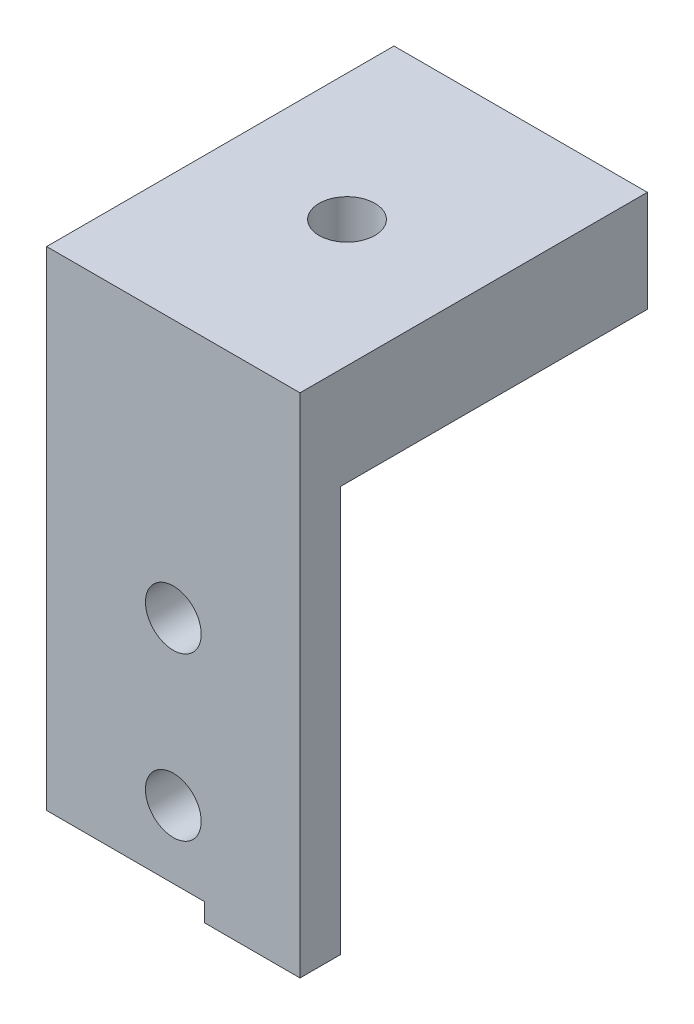
ISO-10303-21;
HEADER;
FILE_DESCRIPTION(('STEP AP214'),'2;1');
FILE_NAME('part.step','',(''),(''),'','','');
FILE_SCHEMA(('AUTOMOTIVE_DESIGN { 1 0 10303 214 1 1 1 1 }'));
ENDSEC;
DATA;
#1=APPLICATION_CONTEXT('core data for automotive mechanical design processes');
#2=APPLICATION_PROTOCOL_DEFINITION('international standard','automotive_design',2000,#1);
#3=PRODUCT_CONTEXT('',#1,'mechanical');
#4=PRODUCT('Part','Part','',(#3));
#5=PRODUCT_RELATED_PRODUCT_CATEGORY('part','',(#4));
#6=PRODUCT_DEFINITION_FORMATION('','',#4);
#7=PRODUCT_DEFINITION_CONTEXT('part definition',#1,'design');
#8=PRODUCT_DEFINITION('design','',#6,#7);
#9=PRODUCT_DEFINITION_SHAPE('','',#8);
#10=(LENGTH_UNIT() NAMED_UNIT(*) SI_UNIT(.MILLI.,.METRE.));
#11=(NAMED_UNIT(*) PLANE_ANGLE_UNIT() SI_UNIT($,.RADIAN.));
#12=(NAMED_UNIT(*) SI_UNIT($,.STERADIAN.) SOLID_ANGLE_UNIT());
#13=UNCERTAINTY_MEASURE_WITH_UNIT(LENGTH_MEASURE(1.E-05),#10,'distance_accuracy_value','');
#14=(GEOMETRIC_REPRESENTATION_CONTEXT(3) GLOBAL_UNCERTAINTY_ASSIGNED_CONTEXT((#13)) GLOBAL_UNIT_ASSIGNED_CONTEXT((#10,
#11,#12)) REPRESENTATION_CONTEXT('',''));
#15=CARTESIAN_POINT('',(0.,0.,0.));
#16=DIRECTION('',(0.,0.,1.));
#17=DIRECTION('',(1.,0.,0.));
#18=AXIS2_PLACEMENT_3D('',#15,#16,#17);
#19=CARTESIAN_POINT('',(0.,0.,0.));
#20=DIRECTION('',(0.,-1.,0.));
#21=DIRECTION('',(0.,0.,-1.));
#22=AXIS2_PLACEMENT_3D('',#19,#20,#21);
#23=PLANE('',#22);
#24=DIRECTION('',(0.,0.,-1.));
#25=VECTOR('',#24,1.);
#26=CARTESIAN_POINT('',(0.,0.,0.));
#27=LINE('',#26,#25);
#28=CARTESIAN_POINT('',(0.,0.,-2.));
#29=VERTEX_POINT('',#28);
#30=CARTESIAN_POINT('',(0.,0.,-17.135));
#31=VERTEX_POINT('',#30);
#32=EDGE_CURVE('E216',#29,#31,#27,.T.);
#33=ORIENTED_EDGE('',*,*,#32,.F.);
#34=DIRECTION('',(-1.,0.,0.));
#35=VECTOR('',#34,1.);
#36=CARTESIAN_POINT('',(0.,0.,-2.));
#37=LINE('',#36,#35);
#38=CARTESIAN_POINT('',(-12.5,0.,-2.));
#39=VERTEX_POINT('',#38);
#40=EDGE_CURVE('E141',#29,#39,#37,.T.);
#41=ORIENTED_EDGE('',*,*,#40,.T.);
#42=DIRECTION('',(0.,0.,-1.));
#43=VECTOR('',#42,1.);
#44=CARTESIAN_POINT('',(-12.5,0.,0.));
#45=LINE('',#44,#43);
#46=CARTESIAN_POINT('',(-12.5,0.,-17.135));
#47=VERTEX_POINT('',#46);
#48=EDGE_CURVE('E159',#39,#47,#45,.T.);
#49=ORIENTED_EDGE('',*,*,#48,.T.);
#50=DIRECTION('',(-1.,0.,0.));
#51=VECTOR('',#50,1.);
#52=CARTESIAN_POINT('',(0.,0.,-17.135));
#53=LINE('',#52,#51);
#54=EDGE_CURVE('E135',#31,#47,#53,.T.);
#55=ORIENTED_EDGE('',*,*,#54,.F.);
#56=EDGE_LOOP('',(#33,#41,#49,#55));
#57=FACE_BOUND('',#56,.T.);
#58=CARTESIAN_POINT('',(-6.25,0.,-8.5675));
#59=DIRECTION('',(0.,-1.,0.));
#60=DIRECTION('',(0.,0.,1.));
#61=AXIS2_PLACEMENT_3D('',#58,#59,#60);
#62=CIRCLE('',#61,1.375);
#63=CARTESIAN_POINT('',(-6.25,0.,-7.1925));
#64=VERTEX_POINT('',#63);
#65=EDGE_CURVE('E163',#64,#64,#62,.T.);
#66=ORIENTED_EDGE('',*,*,#65,.F.);
#67=EDGE_LOOP('',(#66));
#68=FACE_BOUND('',#67,.T.);
#69=ADVANCED_FACE('F44',(#57,#68),#23,.T.);
#70=CARTESIAN_POINT('',(0.,5.,0.));
#71=DIRECTION('',(0.,0.,-1.));
#72=DIRECTION('',(-1.,0.,0.));
#73=AXIS2_PLACEMENT_3D('',#70,#71,#72);
#74=PLANE('',#73);
#75=DIRECTION('',(1.,0.,0.));
#76=VECTOR('',#75,1.);
#77=CARTESIAN_POINT('',(0.,-20.,0.));
#78=LINE('',#77,#76);
#79=CARTESIAN_POINT('',(-4.71050671,-20.,0.));
#80=VERTEX_POINT('',#79);
#81=CARTESIAN_POINT('',(0.,-20.,0.));
#82=VERTEX_POINT('',#81);
#83=EDGE_CURVE('E126',#80,#82,#78,.T.);
#84=ORIENTED_EDGE('',*,*,#83,.T.);
#85=DIRECTION('',(0.,1.,0.));
#86=VECTOR('',#85,1.);
#87=CARTESIAN_POINT('',(0.,5.,0.));
#88=LINE('',#87,#86);
#89=CARTESIAN_POINT('',(0.,5.,0.));
#90=VERTEX_POINT('',#89);
#91=EDGE_CURVE('E60',#82,#90,#88,.T.);
#92=ORIENTED_EDGE('',*,*,#91,.T.);
#93=DIRECTION('',(1.,0.,0.));
#94=VECTOR('',#93,1.);
#95=CARTESIAN_POINT('',(0.,5.,0.));
#96=LINE('',#95,#94);
#97=CARTESIAN_POINT('',(-12.5,5.,0.));
#98=VERTEX_POINT('',#97);
#99=EDGE_CURVE('E123',#98,#90,#96,.T.);
#100=ORIENTED_EDGE('',*,*,#99,.F.);
#101=DIRECTION('',(0.,-1.,0.));
#102=VECTOR('',#101,1.);
#103=CARTESIAN_POINT('',(-12.5,5.,0.));
#104=LINE('',#103,#102);
#105=CARTESIAN_POINT('',(-12.5,-19.09402601,0.));
#106=VERTEX_POINT('',#105);
#107=EDGE_CURVE('E152',#98,#106,#104,.T.);
#108=ORIENTED_EDGE('',*,*,#107,.T.);
#109=DIRECTION('',(-1.,0.,0.));
#110=VECTOR('',#109,1.);
#111=CARTESIAN_POINT('',(0.,-19.09402601,0.));
#112=LINE('',#111,#110);
#113=CARTESIAN_POINT('',(-4.71050671,-19.09402601,0.));
#114=VERTEX_POINT('',#113);
#115=EDGE_CURVE('E190',#114,#106,#112,.T.);
#116=ORIENTED_EDGE('',*,*,#115,.F.);
#117=DIRECTION('',(0.,1.,0.));
#118=VECTOR('',#117,1.);
#119=CARTESIAN_POINT('',(-4.71050671,5.,0.));
#120=LINE('',#119,#118);
#121=EDGE_CURVE('E197',#80,#114,#120,.T.);
#122=ORIENTED_EDGE('',*,*,#121,.F.);
#123=EDGE_LOOP('',(#84,#92,#100,#108,#116,#122));
#124=FACE_BOUND('',#123,.T.);
#125=CARTESIAN_POINT('',(-6.25,-15.75,0.));
#126=DIRECTION('',(0.,0.,1.));
#127=DIRECTION('',(-1.,0.,0.));
#128=AXIS2_PLACEMENT_3D('',#125,#126,#127);
#129=CIRCLE('',#128,1.375);
#130=CARTESIAN_POINT('',(-7.625,-15.75,0.));
#131=VERTEX_POINT('',#130);
#132=EDGE_CURVE('E170',#131,#131,#129,.T.);
#133=ORIENTED_EDGE('',*,*,#132,.F.);
#134=EDGE_LOOP('',(#133));
#135=FACE_BOUND('',#134,.T.);
#136=CARTESIAN_POINT('',(-6.25,-7.75,0.));
#137=DIRECTION('',(0.,0.,1.));
#138=DIRECTION('',(1.,0.,0.));
#139=AXIS2_PLACEMENT_3D('',#136,#137,#138);
#140=CIRCLE('',#139,1.375);
#141=CARTESIAN_POINT('',(-4.875,-7.75,0.));
#142=VERTEX_POINT('',#141);
#143=EDGE_CURVE('E174',#142,#142,#140,.T.);
#144=ORIENTED_EDGE('',*,*,#143,.F.);
#145=EDGE_LOOP('',(#144));
#146=FACE_BOUND('',#145,.T.);
#147=ADVANCED_FACE('F46',(#124,#135,#146),#74,.F.);
#148=CARTESIAN_POINT('',(0.,5.,-17.135));
#149=DIRECTION('',(0.,0.,1.));
#150=DIRECTION('',(1.,0.,0.));
#151=AXIS2_PLACEMENT_3D('',#148,#149,#150);
#152=PLANE('',#151);
#153=DIRECTION('',(-1.,0.,0.));
#154=VECTOR('',#153,1.);
#155=CARTESIAN_POINT('',(0.,5.,-17.135));
#156=LINE('',#155,#154);
#157=CARTESIAN_POINT('',(0.,5.,-17.135));
#158=VERTEX_POINT('',#157);
#159=CARTESIAN_POINT('',(-12.5,5.,-17.135));
#160=VERTEX_POINT('',#159);
#161=EDGE_CURVE('E53',#158,#160,#156,.T.);
#162=ORIENTED_EDGE('',*,*,#161,.F.);
#163=DIRECTION('',(0.,-1.,0.));
#164=VECTOR('',#163,1.);
#165=CARTESIAN_POINT('',(0.,5.,-17.135));
#166=LINE('',#165,#164);
#167=EDGE_CURVE('E112',#158,#31,#166,.T.);
#168=ORIENTED_EDGE('',*,*,#167,.T.);
#169=ORIENTED_EDGE('',*,*,#54,.T.);
#170=DIRECTION('',(0.,-1.,0.));
#171=VECTOR('',#170,1.);
#172=CARTESIAN_POINT('',(-12.5,5.,-17.135));
#173=LINE('',#172,#171);
#174=EDGE_CURVE('E155',#160,#47,#173,.T.);
#175=ORIENTED_EDGE('',*,*,#174,.F.);
#176=EDGE_LOOP('',(#162,#168,#169,#175));
#177=FACE_BOUND('',#176,.T.);
#178=ADVANCED_FACE('F235',(#177),#152,.F.);
#179=CARTESIAN_POINT('',(0.,5.,0.));
#180=DIRECTION('',(0.,-1.,0.));
#181=DIRECTION('',(0.,0.,-1.));
#182=AXIS2_PLACEMENT_3D('',#179,#180,#181);
#183=PLANE('',#182);
#184=ORIENTED_EDGE('',*,*,#99,.T.);
#185=DIRECTION('',(0.,0.,-1.));
#186=VECTOR('',#185,1.);
#187=CARTESIAN_POINT('',(0.,5.,0.));
#188=LINE('',#187,#186);
#189=EDGE_CURVE('E109',#90,#158,#188,.T.);
#190=ORIENTED_EDGE('',*,*,#189,.T.);
#191=ORIENTED_EDGE('',*,*,#161,.T.);
#192=DIRECTION('',(0.,0.,-1.));
#193=VECTOR('',#192,1.);
#194=CARTESIAN_POINT('',(-12.5,5.,0.));
#195=LINE('',#194,#193);
#196=EDGE_CURVE('E132',#98,#160,#195,.T.);
#197=ORIENTED_EDGE('',*,*,#196,.F.);
#198=EDGE_LOOP('',(#184,#190,#191,#197));
#199=FACE_BOUND('',#198,.T.);
#200=CARTESIAN_POINT('',(-6.25,5.,-8.5675));
#201=DIRECTION('',(0.,-1.,0.));
#202=DIRECTION('',(0.,0.,1.));
#203=AXIS2_PLACEMENT_3D('',#200,#201,#202);
#204=CIRCLE('',#203,1.375);
#205=CARTESIAN_POINT('',(-6.25,5.,-7.1925));
#206=VERTEX_POINT('',#205);
#207=EDGE_CURVE('E166',#206,#206,#204,.T.);
#208=ORIENTED_EDGE('',*,*,#207,.T.);
#209=EDGE_LOOP('',(#208));
#210=FACE_BOUND('',#209,.T.);
#211=ADVANCED_FACE('F129',(#199,#210),#183,.F.);
#212=CARTESIAN_POINT('',(0.,5.,-2.));
#213=DIRECTION('',(0.,0.,-1.));
#214=DIRECTION('',(-1.,0.,0.));
#215=AXIS2_PLACEMENT_3D('',#212,#213,#214);
#216=PLANE('',#215);
#217=DIRECTION('',(0.,1.,0.));
#218=VECTOR('',#217,1.);
#219=CARTESIAN_POINT('',(0.,5.,-2.));
#220=LINE('',#219,#218);
#221=CARTESIAN_POINT('',(0.,-20.,-2.));
#222=VERTEX_POINT('',#221);
#223=EDGE_CURVE('E117',#222,#29,#220,.T.);
#224=ORIENTED_EDGE('',*,*,#223,.F.);
#225=DIRECTION('',(1.,0.,0.));
#226=VECTOR('',#225,1.);
#227=CARTESIAN_POINT('',(0.,-20.,-2.));
#228=LINE('',#227,#226);
#229=CARTESIAN_POINT('',(-4.71050671,-20.,-2.));
#230=VERTEX_POINT('',#229);
#231=EDGE_CURVE('E67',#230,#222,#228,.T.);
#232=ORIENTED_EDGE('',*,*,#231,.F.);
#233=DIRECTION('',(0.,1.,0.));
#234=VECTOR('',#233,1.);
#235=CARTESIAN_POINT('',(-4.71050671,-21.,-2.));
#236=LINE('',#235,#234);
#237=CARTESIAN_POINT('',(-4.71050671,-19.09402601,-2.));
#238=VERTEX_POINT('',#237);
#239=EDGE_CURVE('E211',#230,#238,#236,.T.);
#240=ORIENTED_EDGE('',*,*,#239,.T.);
#241=DIRECTION('',(-1.,0.,0.));
#242=VECTOR('',#241,1.);
#243=CARTESIAN_POINT('',(-12.5,-19.09402601,-2.));
#244=LINE('',#243,#242);
#245=CARTESIAN_POINT('',(-12.5,-19.09402601,-2.));
#246=VERTEX_POINT('',#245);
#247=EDGE_CURVE('E205',#238,#246,#244,.T.);
#248=ORIENTED_EDGE('',*,*,#247,.T.);
#249=DIRECTION('',(0.,1.,0.));
#250=VECTOR('',#249,1.);
#251=CARTESIAN_POINT('',(-12.5,0.,-2.));
#252=LINE('',#251,#250);
#253=EDGE_CURVE('E186',#246,#39,#252,.T.);
#254=ORIENTED_EDGE('',*,*,#253,.T.);
#255=ORIENTED_EDGE('',*,*,#40,.F.);
#256=EDGE_LOOP('',(#224,#232,#240,#248,#254,#255));
#257=FACE_BOUND('',#256,.T.);
#258=CARTESIAN_POINT('',(-6.25,-7.75,-2.));
#259=DIRECTION('',(0.,0.,1.));
#260=DIRECTION('',(1.,0.,0.));
#261=AXIS2_PLACEMENT_3D('',#258,#259,#260);
#262=CIRCLE('',#261,1.375);
#263=CARTESIAN_POINT('',(-4.875,-7.75,-2.));
#264=VERTEX_POINT('',#263);
#265=EDGE_CURVE('E182',#264,#264,#262,.F.);
#266=ORIENTED_EDGE('',*,*,#265,.F.);
#267=EDGE_LOOP('',(#266));
#268=FACE_BOUND('',#267,.T.);
#269=CARTESIAN_POINT('',(-6.25,-15.75,-2.));
#270=DIRECTION('',(0.,0.,1.));
#271=DIRECTION('',(1.,0.,0.));
#272=AXIS2_PLACEMENT_3D('',#269,#270,#271);
#273=CIRCLE('',#272,1.375);
#274=CARTESIAN_POINT('',(-4.875,-15.75,-2.));
#275=VERTEX_POINT('',#274);
#276=EDGE_CURVE('E178',#275,#275,#273,.F.);
#277=ORIENTED_EDGE('',*,*,#276,.F.);
#278=EDGE_LOOP('',(#277));
#279=FACE_BOUND('',#278,.T.);
#280=ADVANCED_FACE('F226',(#257,#268,#279),#216,.T.);
#281=CARTESIAN_POINT('',(0.,-20.,8.));
#282=DIRECTION('',(0.,1.,0.));
#283=DIRECTION('',(0.,0.,1.));
#284=AXIS2_PLACEMENT_3D('',#281,#282,#283);
#285=PLANE('',#284);
#286=ORIENTED_EDGE('',*,*,#231,.T.);
#287=DIRECTION('',(0.,0.,1.));
#288=VECTOR('',#287,1.);
#289=CARTESIAN_POINT('',(0.,-20.,8.));
#290=LINE('',#289,#288);
#291=EDGE_CURVE('E12',#222,#82,#290,.T.);
#292=ORIENTED_EDGE('',*,*,#291,.T.);
#293=ORIENTED_EDGE('',*,*,#83,.F.);
#294=DIRECTION('',(0.,0.,-1.));
#295=VECTOR('',#294,1.);
#296=CARTESIAN_POINT('',(-4.71050671,-20.,8.));
#297=LINE('',#296,#295);
#298=EDGE_CURVE('E149',#80,#230,#297,.T.);
#299=ORIENTED_EDGE('',*,*,#298,.T.);
#300=EDGE_LOOP('',(#286,#292,#293,#299));
#301=FACE_BOUND('',#300,.T.);
#302=ADVANCED_FACE('F249',(#301),#285,.F.);
#303=CARTESIAN_POINT('',(-6.25,-7.75,0.));
#304=DIRECTION('',(0.,0.,-1.));
#305=DIRECTION('',(1.,0.,0.));
#306=AXIS2_PLACEMENT_3D('',#303,#304,#305);
#307=CYLINDRICAL_SURFACE('',#306,1.375);
#308=ORIENTED_EDGE('',*,*,#143,.T.);
#309=EDGE_LOOP('',(#308));
#310=FACE_BOUND('',#309,.T.);
#311=ORIENTED_EDGE('',*,*,#265,.T.);
#312=EDGE_LOOP('',(#311));
#313=FACE_BOUND('',#312,.T.);
#314=ADVANCED_FACE('F252',(#310,#313),#307,.F.);
#315=CARTESIAN_POINT('',(-6.25,-15.75,0.));
#316=DIRECTION('',(0.,0.,-1.));
#317=DIRECTION('',(1.,0.,0.));
#318=AXIS2_PLACEMENT_3D('',#315,#316,#317);
#319=CYLINDRICAL_SURFACE('',#318,1.375);
#320=ORIENTED_EDGE('',*,*,#132,.T.);
#321=EDGE_LOOP('',(#320));
#322=FACE_BOUND('',#321,.T.);
#323=ORIENTED_EDGE('',*,*,#276,.T.);
#324=EDGE_LOOP('',(#323));
#325=FACE_BOUND('',#324,.T.);
#326=ADVANCED_FACE('F257',(#322,#325),#319,.F.);
#327=CARTESIAN_POINT('',(-12.5,5.,0.));
#328=DIRECTION('',(1.,0.,0.));
#329=DIRECTION('',(0.,0.,1.));
#330=AXIS2_PLACEMENT_3D('',#327,#328,#329);
#331=PLANE('',#330);
#332=ORIENTED_EDGE('',*,*,#107,.F.);
#333=ORIENTED_EDGE('',*,*,#196,.T.);
#334=ORIENTED_EDGE('',*,*,#174,.T.);
#335=ORIENTED_EDGE('',*,*,#48,.F.);
#336=ORIENTED_EDGE('',*,*,#253,.F.);
#337=DIRECTION('',(0.,0.,-1.));
#338=VECTOR('',#337,1.);
#339=CARTESIAN_POINT('',(-12.5,-19.09402601,8.));
#340=LINE('',#339,#338);
#341=EDGE_CURVE('E201',#106,#246,#340,.T.);
#342=ORIENTED_EDGE('',*,*,#341,.F.);
#343=EDGE_LOOP('',(#332,#333,#334,#335,#336,#342));
#344=FACE_BOUND('',#343,.T.);
#345=ADVANCED_FACE('F232',(#344),#331,.F.);
#346=CARTESIAN_POINT('',(-6.25,0.,-8.5675));
#347=DIRECTION('',(0.,1.,0.));
#348=DIRECTION('',(0.,0.,1.));
#349=AXIS2_PLACEMENT_3D('',#346,#347,#348);
#350=CYLINDRICAL_SURFACE('',#349,1.375);
#351=ORIENTED_EDGE('',*,*,#65,.T.);
#352=EDGE_LOOP('',(#351));
#353=FACE_BOUND('',#352,.T.);
#354=ORIENTED_EDGE('',*,*,#207,.F.);
#355=EDGE_LOOP('',(#354));
#356=FACE_BOUND('',#355,.T.);
#357=ADVANCED_FACE('F256',(#353,#356),#350,.F.);
#358=CARTESIAN_POINT('',(-12.5,-19.09402601,8.));
#359=DIRECTION('',(0.,1.,0.));
#360=DIRECTION('',(0.,0.,1.));
#361=AXIS2_PLACEMENT_3D('',#358,#359,#360);
#362=PLANE('',#361);
#363=DIRECTION('',(0.,0.,-1.));
#364=VECTOR('',#363,1.);
#365=CARTESIAN_POINT('',(-4.71050671,-19.09402601,8.));
#366=LINE('',#365,#364);
#367=EDGE_CURVE('E202',#114,#238,#366,.T.);
#368=ORIENTED_EDGE('',*,*,#367,.F.);
#369=ORIENTED_EDGE('',*,*,#115,.T.);
#370=ORIENTED_EDGE('',*,*,#341,.T.);
#371=ORIENTED_EDGE('',*,*,#247,.F.);
#372=EDGE_LOOP('',(#368,#369,#370,#371));
#373=FACE_BOUND('',#372,.T.);
#374=ADVANCED_FACE('F260',(#373),#362,.F.);
#375=CARTESIAN_POINT('',(-4.71050671,-21.,8.));
#376=DIRECTION('',(1.,0.,0.));
#377=DIRECTION('',(0.,0.,1.));
#378=AXIS2_PLACEMENT_3D('',#375,#376,#377);
#379=PLANE('',#378);
#380=ORIENTED_EDGE('',*,*,#121,.T.);
#381=ORIENTED_EDGE('',*,*,#367,.T.);
#382=ORIENTED_EDGE('',*,*,#239,.F.);
#383=ORIENTED_EDGE('',*,*,#298,.F.);
#384=EDGE_LOOP('',(#380,#381,#382,#383));
#385=FACE_BOUND('',#384,.T.);
#386=ADVANCED_FACE('F268',(#385),#379,.F.);
#387=CARTESIAN_POINT('',(0.,5.,0.));
#388=DIRECTION('',(-1.,0.,0.));
#389=DIRECTION('',(0.,0.,1.));
#390=AXIS2_PLACEMENT_3D('',#387,#388,#389);
#391=PLANE('',#390);
#392=ORIENTED_EDGE('',*,*,#189,.F.);
#393=ORIENTED_EDGE('',*,*,#91,.F.);
#394=ORIENTED_EDGE('',*,*,#291,.F.);
#395=ORIENTED_EDGE('',*,*,#223,.T.);
#396=ORIENTED_EDGE('',*,*,#32,.T.);
#397=ORIENTED_EDGE('',*,*,#167,.F.);
#398=EDGE_LOOP('',(#392,#393,#394,#395,#396,#397));
#399=FACE_BOUND('',#398,.T.);
#400=ADVANCED_FACE('F110',(#399),#391,.F.);
#401=CLOSED_SHELL('',(#69,#147,#178,#211,#280,#302,#314,#326,#345,#357,#374,#386,#400));
#402=MANIFOLD_SOLID_BREP('B2',#401);
#403=ADVANCED_BREP_SHAPE_REPRESENTATION('',(#18,#402),#14);
#404=SHAPE_DEFINITION_REPRESENTATION(#9,#403);
ENDSEC;
END-ISO-10303-21;
